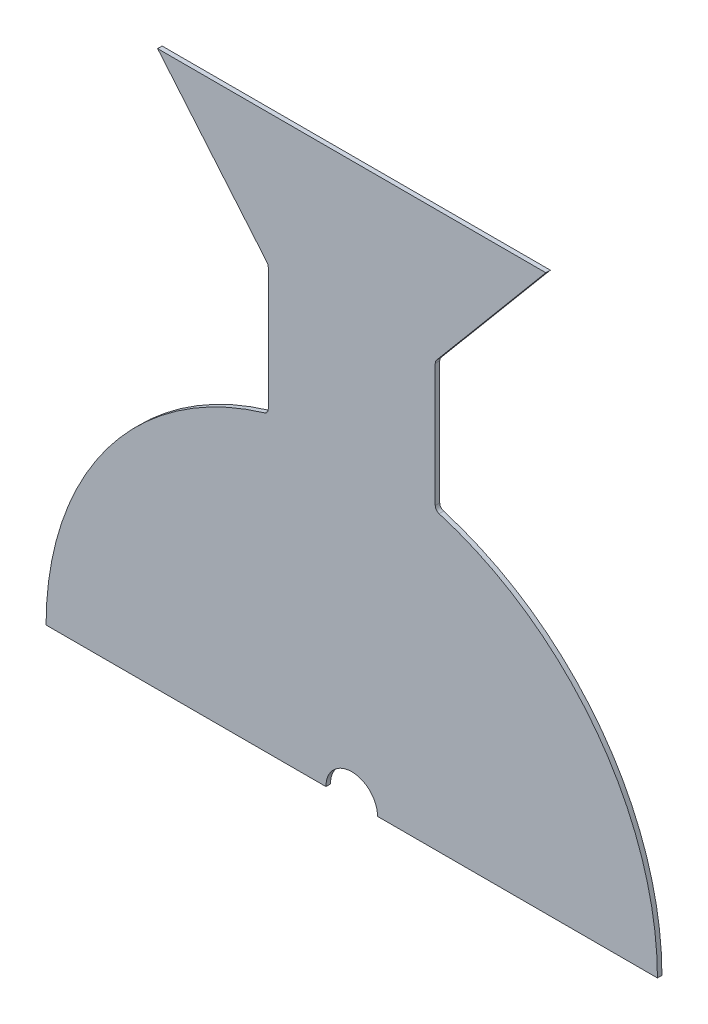
ISO-10303-21;
HEADER;
FILE_DESCRIPTION(('STEP AP214'),'2;1');
FILE_NAME('part.step','',(''),(''),'','','');
FILE_SCHEMA(('AUTOMOTIVE_DESIGN { 1 0 10303 214 1 1 1 1 }'));
ENDSEC;
DATA;
#1=APPLICATION_CONTEXT('core data for automotive mechanical design processes');
#2=APPLICATION_PROTOCOL_DEFINITION('international standard','automotive_design',2000,#1);
#3=PRODUCT_CONTEXT('',#1,'mechanical');
#4=PRODUCT('Part','Part','',(#3));
#5=PRODUCT_RELATED_PRODUCT_CATEGORY('part','',(#4));
#6=PRODUCT_DEFINITION_FORMATION('','',#4);
#7=PRODUCT_DEFINITION_CONTEXT('part definition',#1,'design');
#8=PRODUCT_DEFINITION('design','',#6,#7);
#9=PRODUCT_DEFINITION_SHAPE('','',#8);
#10=(LENGTH_UNIT() NAMED_UNIT(*) SI_UNIT(.MILLI.,.METRE.));
#11=(NAMED_UNIT(*) PLANE_ANGLE_UNIT() SI_UNIT($,.RADIAN.));
#12=(NAMED_UNIT(*) SI_UNIT($,.STERADIAN.) SOLID_ANGLE_UNIT());
#13=UNCERTAINTY_MEASURE_WITH_UNIT(LENGTH_MEASURE(1.E-05),#10,'distance_accuracy_value','');
#14=(GEOMETRIC_REPRESENTATION_CONTEXT(3) GLOBAL_UNCERTAINTY_ASSIGNED_CONTEXT((#13)) GLOBAL_UNIT_ASSIGNED_CONTEXT((#10,
#11,#12)) REPRESENTATION_CONTEXT('',''));
#15=CARTESIAN_POINT('',(0.,0.,0.));
#16=DIRECTION('',(0.,0.,1.));
#17=DIRECTION('',(1.,0.,0.));
#18=AXIS2_PLACEMENT_3D('',#15,#16,#17);
#19=CARTESIAN_POINT('',(0.,0.,-2.65684));
#20=DIRECTION('',(0.,0.,1.));
#21=DIRECTION('',(1.,0.,0.));
#22=AXIS2_PLACEMENT_3D('',#19,#20,#21);
#23=CYLINDRICAL_SURFACE('',#22,180.45684);
#24=CARTESIAN_POINT('',(0.,0.,0.));
#25=DIRECTION('',(0.,0.,1.));
#26=DIRECTION('',(-1.,0.,0.));
#27=AXIS2_PLACEMENT_3D('',#24,#25,#26);
#28=CIRCLE('',#27,180.45684);
#29=CARTESIAN_POINT('',(-51.5590971428571,172.934469104916,0.));
#30=VERTEX_POINT('',#29);
#31=CARTESIAN_POINT('',(-180.45684,0.,0.));
#32=VERTEX_POINT('',#31);
#33=EDGE_CURVE('E180',#30,#32,#28,.T.);
#34=ORIENTED_EDGE('',*,*,#33,.F.);
#35=DIRECTION('',(0.,0.,1.));
#36=VECTOR('',#35,1.);
#37=CARTESIAN_POINT('',(-51.5590971428571,172.934469104916,-2.65684));
#38=LINE('',#37,#36);
#39=CARTESIAN_POINT('',(-51.5590971428571,172.934469104916,-2.65684));
#40=VERTEX_POINT('',#39);
#41=EDGE_CURVE('E53',#30,#40,#38,.F.);
#42=ORIENTED_EDGE('',*,*,#41,.T.);
#43=CARTESIAN_POINT('',(0.,0.,-2.65684));
#44=DIRECTION('',(0.,0.,1.));
#45=DIRECTION('',(-1.,0.,0.));
#46=AXIS2_PLACEMENT_3D('',#43,#44,#45);
#47=CIRCLE('',#46,180.45684);
#48=CARTESIAN_POINT('',(-180.45684,0.,-2.65684));
#49=VERTEX_POINT('',#48);
#50=EDGE_CURVE('E135',#40,#49,#47,.T.);
#51=ORIENTED_EDGE('',*,*,#50,.T.);
#52=DIRECTION('',(0.,0.,1.));
#53=VECTOR('',#52,1.);
#54=CARTESIAN_POINT('',(-180.45684,0.,-2.65684));
#55=LINE('',#54,#53);
#56=EDGE_CURVE('E137',#49,#32,#55,.T.);
#57=ORIENTED_EDGE('',*,*,#56,.T.);
#58=EDGE_LOOP('',(#34,#42,#51,#57));
#59=FACE_BOUND('',#58,.T.);
#60=ADVANCED_FACE('F38',(#59),#23,.T.);
#61=CARTESIAN_POINT('',(-49.29124,173.594483674015,-2.65684));
#62=DIRECTION('',(-1.,0.,0.));
#63=DIRECTION('',(0.,0.,1.));
#64=AXIS2_PLACEMENT_3D('',#61,#62,#63);
#65=PLANE('',#64);
#66=DIRECTION('',(0.,-1.,0.));
#67=VECTOR('',#66,1.);
#68=CARTESIAN_POINT('',(-49.29124,173.594483674015,0.));
#69=LINE('',#68,#67);
#70=CARTESIAN_POINT('',(-49.29124,248.63887818022,0.));
#71=VERTEX_POINT('',#70);
#72=CARTESIAN_POINT('',(-49.29124,175.977118745728,0.));
#73=VERTEX_POINT('',#72);
#74=EDGE_CURVE('E143',#71,#73,#69,.T.);
#75=ORIENTED_EDGE('',*,*,#74,.F.);
#76=DIRECTION('',(0.,0.,1.));
#77=VECTOR('',#76,1.);
#78=CARTESIAN_POINT('',(-49.29124,248.63887818022,-2.65684));
#79=LINE('',#78,#77);
#80=CARTESIAN_POINT('',(-49.29124,248.63887818022,-2.65684));
#81=VERTEX_POINT('',#80);
#82=EDGE_CURVE('E220',#71,#81,#79,.F.);
#83=ORIENTED_EDGE('',*,*,#82,.T.);
#84=DIRECTION('',(0.,-1.,0.));
#85=VECTOR('',#84,1.);
#86=CARTESIAN_POINT('',(-49.29124,173.594483674015,-2.65684));
#87=LINE('',#86,#85);
#88=CARTESIAN_POINT('',(-49.29124,175.977118745728,-2.65684));
#89=VERTEX_POINT('',#88);
#90=EDGE_CURVE('E151',#81,#89,#87,.T.);
#91=ORIENTED_EDGE('',*,*,#90,.T.);
#92=DIRECTION('',(0.,0.,-1.));
#93=VECTOR('',#92,1.);
#94=CARTESIAN_POINT('',(-49.29124,175.977118745728,0.));
#95=LINE('',#94,#93);
#96=EDGE_CURVE('E217',#89,#73,#95,.F.);
#97=ORIENTED_EDGE('',*,*,#96,.T.);
#98=EDGE_LOOP('',(#75,#83,#91,#97));
#99=FACE_BOUND('',#98,.T.);
#100=ADVANCED_FACE('F277',(#99),#65,.T.);
#101=CARTESIAN_POINT('',(-49.29124,249.794483674015,-2.65684));
#102=DIRECTION('',(-0.766044443118977,-0.642787609686541,0.));
#103=DIRECTION('',(0.642787609686541,-0.766044443118977,0.));
#104=AXIS2_PLACEMENT_3D('',#101,#102,#103);
#105=PLANE('',#104);
#106=DIRECTION('',(0.642787609686541,-0.766044443118977,0.));
#107=VECTOR('',#106,1.);
#108=CARTESIAN_POINT('',(-49.29124,249.794483674015,-2.65684));
#109=LINE('',#108,#107);
#110=CARTESIAN_POINT('',(-114.598461144153,327.624599094903,-2.65684));
#111=VERTEX_POINT('',#110);
#112=CARTESIAN_POINT('',(-50.0340488930973,250.679728840975,-2.65684));
#113=VERTEX_POINT('',#112);
#114=EDGE_CURVE('E175',#111,#113,#109,.T.);
#115=ORIENTED_EDGE('',*,*,#114,.T.);
#116=DIRECTION('',(0.,0.,1.));
#117=VECTOR('',#116,1.);
#118=CARTESIAN_POINT('',(-50.0340488930972,250.679728840975,0.));
#119=LINE('',#118,#117);
#120=CARTESIAN_POINT('',(-50.0340488930973,250.679728840975,0.));
#121=VERTEX_POINT('',#120);
#122=EDGE_CURVE('E206',#113,#121,#119,.T.);
#123=ORIENTED_EDGE('',*,*,#122,.T.);
#124=DIRECTION('',(0.642787609686541,-0.766044443118977,0.));
#125=VECTOR('',#124,1.);
#126=CARTESIAN_POINT('',(-49.29124,249.794483674015,0.));
#127=LINE('',#126,#125);
#128=CARTESIAN_POINT('',(-114.598461144153,327.624599094903,0.));
#129=VERTEX_POINT('',#128);
#130=EDGE_CURVE('E200',#129,#121,#127,.T.);
#131=ORIENTED_EDGE('',*,*,#130,.F.);
#132=DIRECTION('',(0.,0.,1.));
#133=VECTOR('',#132,1.);
#134=CARTESIAN_POINT('',(-114.598461144153,327.624599094903,-2.65684));
#135=LINE('',#134,#133);
#136=EDGE_CURVE('E204',#111,#129,#135,.T.);
#137=ORIENTED_EDGE('',*,*,#136,.F.);
#138=EDGE_LOOP('',(#115,#123,#131,#137));
#139=FACE_BOUND('',#138,.T.);
#140=ADVANCED_FACE('F268',(#139),#105,.T.);
#141=CARTESIAN_POINT('',(-114.598461144153,327.624599094903,-2.65684));
#142=DIRECTION('',(0.,1.,0.));
#143=DIRECTION('',(0.,0.,1.));
#144=AXIS2_PLACEMENT_3D('',#141,#142,#143);
#145=PLANE('',#144);
#146=DIRECTION('',(-1.,0.,0.));
#147=VECTOR('',#146,1.);
#148=CARTESIAN_POINT('',(-114.598461144153,327.624599094903,0.));
#149=LINE('',#148,#147);
#150=CARTESIAN_POINT('',(114.598461144153,327.624599094903,0.));
#151=VERTEX_POINT('',#150);
#152=EDGE_CURVE('E197',#151,#129,#149,.T.);
#153=ORIENTED_EDGE('',*,*,#152,.F.);
#154=DIRECTION('',(0.,0.,1.));
#155=VECTOR('',#154,1.);
#156=CARTESIAN_POINT('',(114.598461144153,327.624599094903,-2.65684));
#157=LINE('',#156,#155);
#158=CARTESIAN_POINT('',(114.598461144153,327.624599094903,-2.65684));
#159=VERTEX_POINT('',#158);
#160=EDGE_CURVE('E207',#159,#151,#157,.T.);
#161=ORIENTED_EDGE('',*,*,#160,.F.);
#162=DIRECTION('',(-1.,0.,0.));
#163=VECTOR('',#162,1.);
#164=CARTESIAN_POINT('',(-114.598461144153,327.624599094903,-2.65684));
#165=LINE('',#164,#163);
#166=EDGE_CURVE('E172',#159,#111,#165,.T.);
#167=ORIENTED_EDGE('',*,*,#166,.T.);
#168=ORIENTED_EDGE('',*,*,#136,.T.);
#169=EDGE_LOOP('',(#153,#161,#167,#168));
#170=FACE_BOUND('',#169,.T.);
#171=ADVANCED_FACE('F264',(#170),#145,.T.);
#172=CARTESIAN_POINT('',(49.29124,249.794483674015,-2.65684));
#173=DIRECTION('',(0.766044443118977,-0.642787609686541,0.));
#174=DIRECTION('',(0.642787609686541,0.766044443118977,0.));
#175=AXIS2_PLACEMENT_3D('',#172,#173,#174);
#176=PLANE('',#175);
#177=DIRECTION('',(0.642787609686541,0.766044443118977,0.));
#178=VECTOR('',#177,1.);
#179=CARTESIAN_POINT('',(49.29124,249.794483674015,0.));
#180=LINE('',#179,#178);
#181=CARTESIAN_POINT('',(50.0340488930973,250.679728840975,0.));
#182=VERTEX_POINT('',#181);
#183=EDGE_CURVE('E195',#182,#151,#180,.T.);
#184=ORIENTED_EDGE('',*,*,#183,.F.);
#185=DIRECTION('',(0.,0.,1.));
#186=VECTOR('',#185,1.);
#187=CARTESIAN_POINT('',(50.0340488930972,250.679728840975,-2.65684));
#188=LINE('',#187,#186);
#189=CARTESIAN_POINT('',(50.0340488930973,250.679728840975,-2.65684));
#190=VERTEX_POINT('',#189);
#191=EDGE_CURVE('E230',#182,#190,#188,.F.);
#192=ORIENTED_EDGE('',*,*,#191,.T.);
#193=DIRECTION('',(0.642787609686541,0.766044443118977,0.));
#194=VECTOR('',#193,1.);
#195=CARTESIAN_POINT('',(49.29124,249.794483674015,-2.65684));
#196=LINE('',#195,#194);
#197=EDGE_CURVE('E170',#190,#159,#196,.T.);
#198=ORIENTED_EDGE('',*,*,#197,.T.);
#199=ORIENTED_EDGE('',*,*,#160,.T.);
#200=EDGE_LOOP('',(#184,#192,#198,#199));
#201=FACE_BOUND('',#200,.T.);
#202=ADVANCED_FACE('F260',(#201),#176,.T.);
#203=CARTESIAN_POINT('',(49.29124,173.594483674015,-2.65684));
#204=DIRECTION('',(1.,0.,0.));
#205=DIRECTION('',(0.,0.,-1.));
#206=AXIS2_PLACEMENT_3D('',#203,#204,#205);
#207=PLANE('',#206);
#208=DIRECTION('',(0.,1.,0.));
#209=VECTOR('',#208,1.);
#210=CARTESIAN_POINT('',(49.29124,173.594483674015,0.));
#211=LINE('',#210,#209);
#212=CARTESIAN_POINT('',(49.29124,175.977118745728,0.));
#213=VERTEX_POINT('',#212);
#214=CARTESIAN_POINT('',(49.29124,248.63887818022,0.));
#215=VERTEX_POINT('',#214);
#216=EDGE_CURVE('E192',#213,#215,#211,.T.);
#217=ORIENTED_EDGE('',*,*,#216,.F.);
#218=DIRECTION('',(0.,0.,-1.));
#219=VECTOR('',#218,1.);
#220=CARTESIAN_POINT('',(49.29124,175.977118745728,-2.65684));
#221=LINE('',#220,#219);
#222=CARTESIAN_POINT('',(49.29124,175.977118745728,-2.65684));
#223=VERTEX_POINT('',#222);
#224=EDGE_CURVE('E228',#213,#223,#221,.T.);
#225=ORIENTED_EDGE('',*,*,#224,.T.);
#226=DIRECTION('',(0.,1.,0.));
#227=VECTOR('',#226,1.);
#228=CARTESIAN_POINT('',(49.29124,173.594483674015,-2.65684));
#229=LINE('',#228,#227);
#230=CARTESIAN_POINT('',(49.29124,248.63887818022,-2.65684));
#231=VERTEX_POINT('',#230);
#232=EDGE_CURVE('E167',#223,#231,#229,.T.);
#233=ORIENTED_EDGE('',*,*,#232,.T.);
#234=DIRECTION('',(0.,0.,1.));
#235=VECTOR('',#234,1.);
#236=CARTESIAN_POINT('',(49.29124,248.63887818022,0.));
#237=LINE('',#236,#235);
#238=EDGE_CURVE('E225',#231,#215,#237,.T.);
#239=ORIENTED_EDGE('',*,*,#238,.T.);
#240=EDGE_LOOP('',(#217,#225,#233,#239));
#241=FACE_BOUND('',#240,.T.);
#242=ADVANCED_FACE('F254',(#241),#207,.T.);
#243=CARTESIAN_POINT('',(0.,0.,-2.65684));
#244=DIRECTION('',(0.,0.,1.));
#245=DIRECTION('',(1.,0.,0.));
#246=AXIS2_PLACEMENT_3D('',#243,#244,#245);
#247=CYLINDRICAL_SURFACE('',#246,180.45684);
#248=CARTESIAN_POINT('',(0.,0.,-2.65684));
#249=DIRECTION('',(0.,0.,1.));
#250=DIRECTION('',(-1.,0.,0.));
#251=AXIS2_PLACEMENT_3D('',#248,#249,#250);
#252=CIRCLE('',#251,180.45684);
#253=CARTESIAN_POINT('',(180.45684,0.,-2.65684));
#254=VERTEX_POINT('',#253);
#255=CARTESIAN_POINT('',(51.5590971428571,172.934469104916,-2.65684));
#256=VERTEX_POINT('',#255);
#257=EDGE_CURVE('E164',#254,#256,#252,.T.);
#258=ORIENTED_EDGE('',*,*,#257,.T.);
#259=DIRECTION('',(0.,0.,1.));
#260=VECTOR('',#259,1.);
#261=CARTESIAN_POINT('',(51.5590971428571,172.934469104916,-2.65684));
#262=LINE('',#261,#260);
#263=CARTESIAN_POINT('',(51.5590971428571,172.934469104916,0.));
#264=VERTEX_POINT('',#263);
#265=EDGE_CURVE('E222',#256,#264,#262,.T.);
#266=ORIENTED_EDGE('',*,*,#265,.T.);
#267=CARTESIAN_POINT('',(0.,0.,0.));
#268=DIRECTION('',(0.,0.,1.));
#269=DIRECTION('',(-1.,0.,0.));
#270=AXIS2_PLACEMENT_3D('',#267,#268,#269);
#271=CIRCLE('',#270,180.45684);
#272=CARTESIAN_POINT('',(180.45684,0.,0.));
#273=VERTEX_POINT('',#272);
#274=EDGE_CURVE('E189',#273,#264,#271,.T.);
#275=ORIENTED_EDGE('',*,*,#274,.F.);
#276=DIRECTION('',(0.,0.,1.));
#277=VECTOR('',#276,1.);
#278=CARTESIAN_POINT('',(180.45684,0.,-2.65684));
#279=LINE('',#278,#277);
#280=EDGE_CURVE('E210',#254,#273,#279,.T.);
#281=ORIENTED_EDGE('',*,*,#280,.F.);
#282=EDGE_LOOP('',(#258,#266,#275,#281));
#283=FACE_BOUND('',#282,.T.);
#284=ADVANCED_FACE('F303',(#283),#247,.T.);
#285=CARTESIAN_POINT('',(15.24,0.,-2.65684));
#286=DIRECTION('',(0.,-1.,0.));
#287=DIRECTION('',(1.,0.,0.));
#288=AXIS2_PLACEMENT_3D('',#285,#286,#287);
#289=PLANE('',#288);
#290=DIRECTION('',(1.,0.,0.));
#291=VECTOR('',#290,1.);
#292=CARTESIAN_POINT('',(15.24,0.,0.));
#293=LINE('',#292,#291);
#294=CARTESIAN_POINT('',(15.24,0.,0.));
#295=VERTEX_POINT('',#294);
#296=EDGE_CURVE('E186',#295,#273,#293,.T.);
#297=ORIENTED_EDGE('',*,*,#296,.F.);
#298=DIRECTION('',(0.,0.,1.));
#299=VECTOR('',#298,1.);
#300=CARTESIAN_POINT('',(15.24,0.,-2.65684));
#301=LINE('',#300,#299);
#302=CARTESIAN_POINT('',(15.24,0.,-2.65684));
#303=VERTEX_POINT('',#302);
#304=EDGE_CURVE('E212',#303,#295,#301,.T.);
#305=ORIENTED_EDGE('',*,*,#304,.F.);
#306=DIRECTION('',(1.,0.,0.));
#307=VECTOR('',#306,1.);
#308=CARTESIAN_POINT('',(15.24,0.,-2.65684));
#309=LINE('',#308,#307);
#310=EDGE_CURVE('E159',#303,#254,#309,.T.);
#311=ORIENTED_EDGE('',*,*,#310,.T.);
#312=ORIENTED_EDGE('',*,*,#280,.T.);
#313=EDGE_LOOP('',(#297,#305,#311,#312));
#314=FACE_BOUND('',#313,.T.);
#315=ADVANCED_FACE('F307',(#314),#289,.T.);
#316=CARTESIAN_POINT('',(0.,0.,-2.65684));
#317=DIRECTION('',(0.,0.,1.));
#318=DIRECTION('',(1.,0.,0.));
#319=AXIS2_PLACEMENT_3D('',#316,#317,#318);
#320=CYLINDRICAL_SURFACE('',#319,15.24);
#321=CARTESIAN_POINT('',(0.,0.,0.));
#322=DIRECTION('',(0.,0.,-1.));
#323=DIRECTION('',(-1.,0.,0.));
#324=AXIS2_PLACEMENT_3D('',#321,#322,#323);
#325=CIRCLE('',#324,15.24);
#326=CARTESIAN_POINT('',(-15.24,0.,0.));
#327=VERTEX_POINT('',#326);
#328=EDGE_CURVE('E183',#327,#295,#325,.T.);
#329=ORIENTED_EDGE('',*,*,#328,.F.);
#330=DIRECTION('',(0.,0.,1.));
#331=VECTOR('',#330,1.);
#332=CARTESIAN_POINT('',(-15.24,0.,-2.65684));
#333=LINE('',#332,#331);
#334=CARTESIAN_POINT('',(-15.24,0.,-2.65684));
#335=VERTEX_POINT('',#334);
#336=EDGE_CURVE('E150',#335,#327,#333,.T.);
#337=ORIENTED_EDGE('',*,*,#336,.F.);
#338=CARTESIAN_POINT('',(0.,0.,-2.65684));
#339=DIRECTION('',(0.,0.,-1.));
#340=DIRECTION('',(-1.,0.,0.));
#341=AXIS2_PLACEMENT_3D('',#338,#339,#340);
#342=CIRCLE('',#341,15.24);
#343=EDGE_CURVE('E157',#335,#303,#342,.T.);
#344=ORIENTED_EDGE('',*,*,#343,.T.);
#345=ORIENTED_EDGE('',*,*,#304,.T.);
#346=EDGE_LOOP('',(#329,#337,#344,#345));
#347=FACE_BOUND('',#346,.T.);
#348=ADVANCED_FACE('F310',(#347),#320,.F.);
#349=CARTESIAN_POINT('',(-180.45684,0.,-2.65684));
#350=DIRECTION('',(0.,-1.,0.));
#351=DIRECTION('',(1.,0.,0.));
#352=AXIS2_PLACEMENT_3D('',#349,#350,#351);
#353=PLANE('',#352);
#354=DIRECTION('',(1.,0.,0.));
#355=VECTOR('',#354,1.);
#356=CARTESIAN_POINT('',(-180.45684,0.,0.));
#357=LINE('',#356,#355);
#358=EDGE_CURVE('E149',#32,#327,#357,.T.);
#359=ORIENTED_EDGE('',*,*,#358,.F.);
#360=ORIENTED_EDGE('',*,*,#56,.F.);
#361=DIRECTION('',(1.,0.,0.));
#362=VECTOR('',#361,1.);
#363=CARTESIAN_POINT('',(-180.45684,0.,-2.65684));
#364=LINE('',#363,#362);
#365=EDGE_CURVE('E142',#49,#335,#364,.T.);
#366=ORIENTED_EDGE('',*,*,#365,.T.);
#367=ORIENTED_EDGE('',*,*,#336,.T.);
#368=EDGE_LOOP('',(#359,#360,#366,#367));
#369=FACE_BOUND('',#368,.T.);
#370=ADVANCED_FACE('F147',(#369),#353,.T.);
#371=CARTESIAN_POINT('',(0.,0.,-2.65684));
#372=DIRECTION('',(0.,0.,-1.));
#373=DIRECTION('',(-1.,0.,0.));
#374=AXIS2_PLACEMENT_3D('',#371,#372,#373);
#375=PLANE('',#374);
#376=ORIENTED_EDGE('',*,*,#50,.F.);
#377=CARTESIAN_POINT('',(-52.46624,175.977118745728,-2.65684));
#378=DIRECTION('',(0.,0.,-1.));
#379=DIRECTION('',(-1.,0.,0.));
#380=AXIS2_PLACEMENT_3D('',#377,#378,#379);
#381=CIRCLE('',#380,3.175);
#382=EDGE_CURVE('E11',#40,#89,#381,.F.);
#383=ORIENTED_EDGE('',*,*,#382,.T.);
#384=ORIENTED_EDGE('',*,*,#90,.F.);
#385=CARTESIAN_POINT('',(-52.46624,248.63887818022,-2.65684));
#386=DIRECTION('',(0.,0.,-1.));
#387=DIRECTION('',(-1.,0.,0.));
#388=AXIS2_PLACEMENT_3D('',#385,#386,#387);
#389=CIRCLE('',#388,3.175);
#390=EDGE_CURVE('E235',#81,#113,#389,.F.);
#391=ORIENTED_EDGE('',*,*,#390,.T.);
#392=ORIENTED_EDGE('',*,*,#114,.F.);
#393=ORIENTED_EDGE('',*,*,#166,.F.);
#394=ORIENTED_EDGE('',*,*,#197,.F.);
#395=CARTESIAN_POINT('',(52.46624,248.63887818022,-2.65684));
#396=DIRECTION('',(0.,0.,-1.));
#397=DIRECTION('',(-1.,0.,0.));
#398=AXIS2_PLACEMENT_3D('',#395,#396,#397);
#399=CIRCLE('',#398,3.175);
#400=EDGE_CURVE('E243',#190,#231,#399,.F.);
#401=ORIENTED_EDGE('',*,*,#400,.T.);
#402=ORIENTED_EDGE('',*,*,#232,.F.);
#403=CARTESIAN_POINT('',(52.46624,175.977118745728,-2.65684));
#404=DIRECTION('',(0.,0.,-1.));
#405=DIRECTION('',(-1.,0.,0.));
#406=AXIS2_PLACEMENT_3D('',#403,#404,#405);
#407=CIRCLE('',#406,3.175);
#408=EDGE_CURVE('E239',#223,#256,#407,.F.);
#409=ORIENTED_EDGE('',*,*,#408,.T.);
#410=ORIENTED_EDGE('',*,*,#257,.F.);
#411=ORIENTED_EDGE('',*,*,#310,.F.);
#412=ORIENTED_EDGE('',*,*,#343,.F.);
#413=ORIENTED_EDGE('',*,*,#365,.F.);
#414=EDGE_LOOP('',(#376,#383,#384,#391,#392,#393,#394,#401,#402,#409,#410,#411,#412,#413));
#415=FACE_BOUND('',#414,.T.);
#416=ADVANCED_FACE('F154',(#415),#375,.T.);
#417=CARTESIAN_POINT('',(0.,0.,0.));
#418=DIRECTION('',(0.,0.,-1.));
#419=DIRECTION('',(-1.,0.,0.));
#420=AXIS2_PLACEMENT_3D('',#417,#418,#419);
#421=PLANE('',#420);
#422=ORIENTED_EDGE('',*,*,#74,.T.);
#423=CARTESIAN_POINT('',(-52.46624,175.977118745728,0.));
#424=DIRECTION('',(0.,0.,-1.));
#425=DIRECTION('',(-1.,0.,0.));
#426=AXIS2_PLACEMENT_3D('',#423,#424,#425);
#427=CIRCLE('',#426,3.175);
#428=EDGE_CURVE('E46',#73,#30,#427,.T.);
#429=ORIENTED_EDGE('',*,*,#428,.T.);
#430=ORIENTED_EDGE('',*,*,#33,.T.);
#431=ORIENTED_EDGE('',*,*,#358,.T.);
#432=ORIENTED_EDGE('',*,*,#328,.T.);
#433=ORIENTED_EDGE('',*,*,#296,.T.);
#434=ORIENTED_EDGE('',*,*,#274,.T.);
#435=CARTESIAN_POINT('',(52.46624,175.977118745728,0.));
#436=DIRECTION('',(0.,0.,-1.));
#437=DIRECTION('',(-1.,0.,0.));
#438=AXIS2_PLACEMENT_3D('',#435,#436,#437);
#439=CIRCLE('',#438,3.175);
#440=EDGE_CURVE('E237',#264,#213,#439,.T.);
#441=ORIENTED_EDGE('',*,*,#440,.T.);
#442=ORIENTED_EDGE('',*,*,#216,.T.);
#443=CARTESIAN_POINT('',(52.46624,248.63887818022,0.));
#444=DIRECTION('',(0.,0.,-1.));
#445=DIRECTION('',(-1.,0.,0.));
#446=AXIS2_PLACEMENT_3D('',#443,#444,#445);
#447=CIRCLE('',#446,3.175);
#448=EDGE_CURVE('E241',#215,#182,#447,.T.);
#449=ORIENTED_EDGE('',*,*,#448,.T.);
#450=ORIENTED_EDGE('',*,*,#183,.T.);
#451=ORIENTED_EDGE('',*,*,#152,.T.);
#452=ORIENTED_EDGE('',*,*,#130,.T.);
#453=CARTESIAN_POINT('',(-52.46624,248.63887818022,0.));
#454=DIRECTION('',(0.,0.,-1.));
#455=DIRECTION('',(-1.,0.,0.));
#456=AXIS2_PLACEMENT_3D('',#453,#454,#455);
#457=CIRCLE('',#456,3.175);
#458=EDGE_CURVE('E233',#121,#71,#457,.T.);
#459=ORIENTED_EDGE('',*,*,#458,.T.);
#460=EDGE_LOOP('',(#422,#429,#430,#431,#432,#433,#434,#441,#442,#449,#450,#451,#452,#459));
#461=FACE_BOUND('',#460,.T.);
#462=ADVANCED_FACE('F258',(#461),#421,.F.);
#463=CARTESIAN_POINT('',(-52.46624,248.63887818022,-2.65684));
#464=DIRECTION('',(0.,0.,-1.));
#465=DIRECTION('',(-1.,0.,0.));
#466=AXIS2_PLACEMENT_3D('',#463,#464,#465);
#467=CYLINDRICAL_SURFACE('',#466,3.175);
#468=ORIENTED_EDGE('',*,*,#390,.F.);
#469=ORIENTED_EDGE('',*,*,#82,.F.);
#470=ORIENTED_EDGE('',*,*,#458,.F.);
#471=ORIENTED_EDGE('',*,*,#122,.F.);
#472=EDGE_LOOP('',(#468,#469,#470,#471));
#473=FACE_BOUND('',#472,.T.);
#474=ADVANCED_FACE('F273',(#473),#467,.F.);
#475=CARTESIAN_POINT('',(52.46624,175.977118745728,-2.65684));
#476=DIRECTION('',(0.,0.,1.));
#477=DIRECTION('',(1.,0.,0.));
#478=AXIS2_PLACEMENT_3D('',#475,#476,#477);
#479=CYLINDRICAL_SURFACE('',#478,3.175);
#480=ORIENTED_EDGE('',*,*,#408,.F.);
#481=ORIENTED_EDGE('',*,*,#224,.F.);
#482=ORIENTED_EDGE('',*,*,#440,.F.);
#483=ORIENTED_EDGE('',*,*,#265,.F.);
#484=EDGE_LOOP('',(#480,#481,#482,#483));
#485=FACE_BOUND('',#484,.T.);
#486=ADVANCED_FACE('F284',(#485),#479,.F.);
#487=CARTESIAN_POINT('',(52.46624,248.63887818022,-2.65684));
#488=DIRECTION('',(0.,0.,-1.));
#489=DIRECTION('',(-1.,0.,0.));
#490=AXIS2_PLACEMENT_3D('',#487,#488,#489);
#491=CYLINDRICAL_SURFACE('',#490,3.175);
#492=ORIENTED_EDGE('',*,*,#400,.F.);
#493=ORIENTED_EDGE('',*,*,#191,.F.);
#494=ORIENTED_EDGE('',*,*,#448,.F.);
#495=ORIENTED_EDGE('',*,*,#238,.F.);
#496=EDGE_LOOP('',(#492,#493,#494,#495));
#497=FACE_BOUND('',#496,.T.);
#498=ADVANCED_FACE('F256',(#497),#491,.F.);
#499=CARTESIAN_POINT('',(-52.46624,175.977118745728,-2.65684));
#500=DIRECTION('',(0.,0.,1.));
#501=DIRECTION('',(1.,0.,0.));
#502=AXIS2_PLACEMENT_3D('',#499,#500,#501);
#503=CYLINDRICAL_SURFACE('',#502,3.175);
#504=ORIENTED_EDGE('',*,*,#382,.F.);
#505=ORIENTED_EDGE('',*,*,#41,.F.);
#506=ORIENTED_EDGE('',*,*,#428,.F.);
#507=ORIENTED_EDGE('',*,*,#96,.F.);
#508=EDGE_LOOP('',(#504,#505,#506,#507));
#509=FACE_BOUND('',#508,.T.);
#510=ADVANCED_FACE('F40',(#509),#503,.F.);
#511=CLOSED_SHELL('',(#60,#100,#140,#171,#202,#242,#284,#315,#348,#370,#416,#462,#474,#486,#498,#510));
#512=MANIFOLD_SOLID_BREP('B2',#511);
#513=ADVANCED_BREP_SHAPE_REPRESENTATION('',(#18,#512),#14);
#514=SHAPE_DEFINITION_REPRESENTATION(#9,#513);
ENDSEC;
END-ISO-10303-21;
